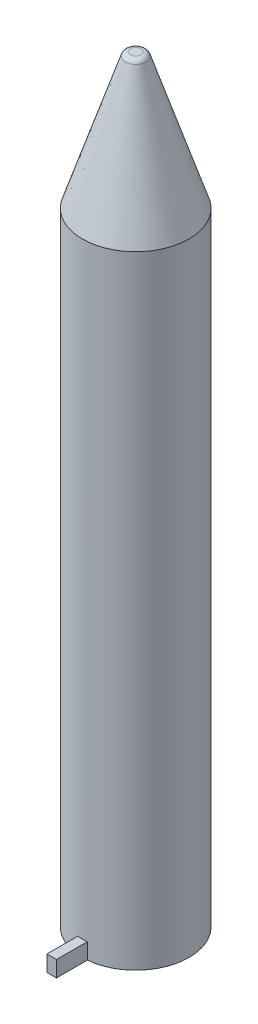
ISO-10303-21;
HEADER;
FILE_DESCRIPTION(('STEP AP214'),'2;1');
FILE_NAME('part.step','',(''),(''),'','','');
FILE_SCHEMA(('AUTOMOTIVE_DESIGN { 1 0 10303 214 1 1 1 1 }'));
ENDSEC;
DATA;
#1=APPLICATION_CONTEXT('core data for automotive mechanical design processes');
#2=APPLICATION_PROTOCOL_DEFINITION('international standard','automotive_design',2000,#1);
#3=PRODUCT_CONTEXT('',#1,'mechanical');
#4=PRODUCT('Part','Part','',(#3));
#5=PRODUCT_RELATED_PRODUCT_CATEGORY('part','',(#4));
#6=PRODUCT_DEFINITION_FORMATION('','',#4);
#7=PRODUCT_DEFINITION_CONTEXT('part definition',#1,'design');
#8=PRODUCT_DEFINITION('design','',#6,#7);
#9=PRODUCT_DEFINITION_SHAPE('','',#8);
#10=(LENGTH_UNIT() NAMED_UNIT(*) SI_UNIT(.MILLI.,.METRE.));
#11=(NAMED_UNIT(*) PLANE_ANGLE_UNIT() SI_UNIT($,.RADIAN.));
#12=(NAMED_UNIT(*) SI_UNIT($,.STERADIAN.) SOLID_ANGLE_UNIT());
#13=UNCERTAINTY_MEASURE_WITH_UNIT(LENGTH_MEASURE(1.E-05),#10,'distance_accuracy_value','');
#14=(GEOMETRIC_REPRESENTATION_CONTEXT(3) GLOBAL_UNCERTAINTY_ASSIGNED_CONTEXT((#13)) GLOBAL_UNIT_ASSIGNED_CONTEXT((#10,
#11,#12)) REPRESENTATION_CONTEXT('',''));
#15=CARTESIAN_POINT('',(0.,0.,0.));
#16=DIRECTION('',(0.,0.,1.));
#17=DIRECTION('',(1.,0.,0.));
#18=AXIS2_PLACEMENT_3D('',#15,#16,#17);
#19=CARTESIAN_POINT('',(0.,116.650008,0.));
#20=DIRECTION('',(0.,-1.,0.));
#21=DIRECTION('',(0.,0.,-1.));
#22=AXIS2_PLACEMENT_3D('',#19,#20,#21);
#23=CYLINDRICAL_SURFACE('',#22,10.);
#24=CARTESIAN_POINT('',(0.,0.,0.));
#25=DIRECTION('',(0.,1.,0.));
#26=DIRECTION('',(0.,0.,1.));
#27=AXIS2_PLACEMENT_3D('',#24,#25,#26);
#28=CIRCLE('',#27,10.);
#29=CARTESIAN_POINT('',(0.899999999999999,0.,9.95941765365827));
#30=VERTEX_POINT('',#29);
#31=CARTESIAN_POINT('',(-0.900000000000001,0.,9.95941765365827));
#32=VERTEX_POINT('',#31);
#33=EDGE_CURVE('E117',#30,#32,#28,.T.);
#34=ORIENTED_EDGE('',*,*,#33,.T.);
#35=DIRECTION('',(0.,-1.,0.));
#36=VECTOR('',#35,1.);
#37=CARTESIAN_POINT('',(-0.900000000000001,116.650008,9.95941765365827));
#38=LINE('',#37,#36);
#39=CARTESIAN_POINT('',(-0.900000000000001,3.,9.95941765365827));
#40=VERTEX_POINT('',#39);
#41=EDGE_CURVE('E53',#32,#40,#38,.F.);
#42=ORIENTED_EDGE('',*,*,#41,.T.);
#43=CARTESIAN_POINT('',(0.,3.,0.));
#44=DIRECTION('',(0.,-1.,0.));
#45=DIRECTION('',(0.,0.,-1.));
#46=AXIS2_PLACEMENT_3D('',#43,#44,#45);
#47=CIRCLE('',#46,10.);
#48=CARTESIAN_POINT('',(0.899999999999999,3.,9.95941765365827));
#49=VERTEX_POINT('',#48);
#50=EDGE_CURVE('E11',#49,#40,#47,.T.);
#51=ORIENTED_EDGE('',*,*,#50,.F.);
#52=DIRECTION('',(0.,-1.,0.));
#53=VECTOR('',#52,1.);
#54=CARTESIAN_POINT('',(0.899999999999999,116.650008,9.95941765365827));
#55=LINE('',#54,#53);
#56=EDGE_CURVE('E82',#49,#30,#55,.T.);
#57=ORIENTED_EDGE('',*,*,#56,.T.);
#58=EDGE_LOOP('',(#34,#42,#51,#57));
#59=FACE_BOUND('',#58,.T.);
#60=CARTESIAN_POINT('',(0.,116.650008,0.));
#61=DIRECTION('',(0.,1.,0.));
#62=DIRECTION('',(0.,0.,1.));
#63=AXIS2_PLACEMENT_3D('',#60,#61,#62);
#64=CIRCLE('',#63,10.);
#65=CARTESIAN_POINT('',(0.,116.650008,10.));
#66=VERTEX_POINT('',#65);
#67=EDGE_CURVE('E46',#66,#66,#64,.T.);
#68=ORIENTED_EDGE('',*,*,#67,.F.);
#69=EDGE_LOOP('',(#68));
#70=FACE_BOUND('',#69,.T.);
#71=ADVANCED_FACE('F39',(#59,#70),#23,.T.);
#72=CARTESIAN_POINT('',(0.,0.,0.));
#73=DIRECTION('',(0.,1.,0.));
#74=DIRECTION('',(0.,0.,1.));
#75=AXIS2_PLACEMENT_3D('',#72,#73,#74);
#76=PLANE('',#75);
#77=CARTESIAN_POINT('',(0.,0.,0.));
#78=DIRECTION('',(0.,-1.,0.));
#79=DIRECTION('',(0.,0.,-1.));
#80=AXIS2_PLACEMENT_3D('',#77,#78,#79);
#81=CIRCLE('',#80,6.);
#82=CARTESIAN_POINT('',(0.,0.,-6.));
#83=VERTEX_POINT('',#82);
#84=EDGE_CURVE('E163',#83,#83,#81,.T.);
#85=ORIENTED_EDGE('',*,*,#84,.F.);
#86=EDGE_LOOP('',(#85));
#87=FACE_BOUND('',#86,.T.);
#88=ORIENTED_EDGE('',*,*,#33,.F.);
#89=DIRECTION('',(0.,0.,1.));
#90=VECTOR('',#89,1.);
#91=CARTESIAN_POINT('',(0.899999999999998,0.,15.75));
#92=LINE('',#91,#90);
#93=CARTESIAN_POINT('',(0.899999999999998,0.,15.75));
#94=VERTEX_POINT('',#93);
#95=EDGE_CURVE('E104',#30,#94,#92,.T.);
#96=ORIENTED_EDGE('',*,*,#95,.T.);
#97=DIRECTION('',(-1.,0.,0.));
#98=VECTOR('',#97,1.);
#99=CARTESIAN_POINT('',(-0.900000000000002,0.,15.75));
#100=LINE('',#99,#98);
#101=CARTESIAN_POINT('',(-0.900000000000002,0.,15.75));
#102=VERTEX_POINT('',#101);
#103=EDGE_CURVE('E92',#94,#102,#100,.T.);
#104=ORIENTED_EDGE('',*,*,#103,.T.);
#105=DIRECTION('',(0.,0.,-1.));
#106=VECTOR('',#105,1.);
#107=CARTESIAN_POINT('',(-0.900000000000002,0.,15.75));
#108=LINE('',#107,#106);
#109=EDGE_CURVE('E101',#102,#32,#108,.T.);
#110=ORIENTED_EDGE('',*,*,#109,.T.);
#111=EDGE_LOOP('',(#88,#96,#104,#110));
#112=FACE_BOUND('',#111,.T.);
#113=ADVANCED_FACE('F124',(#87,#112),#76,.F.);
#114=CARTESIAN_POINT('',(1.,142.050008,0.));
#115=DIRECTION('',(0.,1.,0.));
#116=DIRECTION('',(0.,0.,1.));
#117=AXIS2_PLACEMENT_3D('',#114,#115,#116);
#118=PLANE('',#117);
#119=CARTESIAN_POINT('',(0.,142.050008,0.));
#120=DIRECTION('',(0.,-1.,0.));
#121=DIRECTION('',(0.,0.,-1.));
#122=AXIS2_PLACEMENT_3D('',#119,#120,#121);
#123=CIRCLE('',#122,1.);
#124=CARTESIAN_POINT('',(0.,142.050008,-1.));
#125=VERTEX_POINT('',#124);
#126=EDGE_CURVE('E114',#125,#125,#123,.T.);
#127=ORIENTED_EDGE('',*,*,#126,.F.);
#128=EDGE_LOOP('',(#127));
#129=FACE_BOUND('',#128,.T.);
#130=ADVANCED_FACE('F126',(#129),#118,.T.);
#131=CARTESIAN_POINT('',(0.,141.050008,0.));
#132=DIRECTION('',(0.,-1.,0.));
#133=DIRECTION('',(0.,0.,-1.));
#134=AXIS2_PLACEMENT_3D('',#131,#132,#133);
#135=DEGENERATE_TOROIDAL_SURFACE('',#134,1.,1.,.T.);
#136=ORIENTED_EDGE('',*,*,#126,.T.);
#137=EDGE_LOOP('',(#136));
#138=FACE_BOUND('',#137,.T.);
#139=CARTESIAN_POINT('',(0.,141.359738327842,0.));
#140=DIRECTION('',(0.,-1.,0.));
#141=DIRECTION('',(0.,0.,-1.));
#142=AXIS2_PLACEMENT_3D('',#139,#140,#141);
#143=CIRCLE('',#142,1.95082444437176);
#144=CARTESIAN_POINT('',(0.,141.359738327842,-1.95082444437176));
#145=VERTEX_POINT('',#144);
#146=EDGE_CURVE('E111',#145,#145,#143,.T.);
#147=ORIENTED_EDGE('',*,*,#146,.F.);
#148=EDGE_LOOP('',(#147));
#149=FACE_BOUND('',#148,.T.);
#150=ADVANCED_FACE('F132',(#138,#149),#135,.T.);
#151=CARTESIAN_POINT('',(0.,116.650008,0.));
#152=DIRECTION('',(0.,-1.,0.));
#153=DIRECTION('',(0.,0.,-1.));
#154=AXIS2_PLACEMENT_3D('',#151,#152,#153);
#155=CONICAL_SURFACE('',#154,10.,0.314909400039748);
#156=ORIENTED_EDGE('',*,*,#146,.T.);
#157=EDGE_LOOP('',(#156));
#158=FACE_BOUND('',#157,.T.);
#159=ORIENTED_EDGE('',*,*,#67,.T.);
#160=EDGE_LOOP('',(#159));
#161=FACE_BOUND('',#160,.T.);
#162=ADVANCED_FACE('F139',(#158,#161),#155,.T.);
#163=CARTESIAN_POINT('',(-0.900000000000002,3.,15.75));
#164=DIRECTION('',(-1.,0.,0.));
#165=DIRECTION('',(0.,0.,1.));
#166=AXIS2_PLACEMENT_3D('',#163,#164,#165);
#167=PLANE('',#166);
#168=ORIENTED_EDGE('',*,*,#41,.F.);
#169=ORIENTED_EDGE('',*,*,#109,.F.);
#170=DIRECTION('',(0.,-1.,0.));
#171=VECTOR('',#170,1.);
#172=CARTESIAN_POINT('',(-0.900000000000002,3.,15.75));
#173=LINE('',#172,#171);
#174=CARTESIAN_POINT('',(-0.900000000000002,3.,15.75));
#175=VERTEX_POINT('',#174);
#176=EDGE_CURVE('E93',#175,#102,#173,.T.);
#177=ORIENTED_EDGE('',*,*,#176,.F.);
#178=DIRECTION('',(0.,0.,-1.));
#179=VECTOR('',#178,1.);
#180=CARTESIAN_POINT('',(-0.900000000000002,3.,15.75));
#181=LINE('',#180,#179);
#182=EDGE_CURVE('E86',#175,#40,#181,.T.);
#183=ORIENTED_EDGE('',*,*,#182,.T.);
#184=EDGE_LOOP('',(#168,#169,#177,#183));
#185=FACE_BOUND('',#184,.T.);
#186=ADVANCED_FACE('F123',(#185),#167,.T.);
#187=CARTESIAN_POINT('',(0.899999999999998,3.,15.75));
#188=DIRECTION('',(1.,0.,0.));
#189=DIRECTION('',(0.,0.,-1.));
#190=AXIS2_PLACEMENT_3D('',#187,#188,#189);
#191=PLANE('',#190);
#192=ORIENTED_EDGE('',*,*,#56,.F.);
#193=DIRECTION('',(0.,0.,1.));
#194=VECTOR('',#193,1.);
#195=CARTESIAN_POINT('',(0.899999999999998,3.,15.75));
#196=LINE('',#195,#194);
#197=CARTESIAN_POINT('',(0.899999999999998,3.,15.75));
#198=VERTEX_POINT('',#197);
#199=EDGE_CURVE('E76',#49,#198,#196,.T.);
#200=ORIENTED_EDGE('',*,*,#199,.T.);
#201=DIRECTION('',(0.,-1.,0.));
#202=VECTOR('',#201,1.);
#203=CARTESIAN_POINT('',(0.899999999999998,3.,15.75));
#204=LINE('',#203,#202);
#205=EDGE_CURVE('E80',#198,#94,#204,.T.);
#206=ORIENTED_EDGE('',*,*,#205,.T.);
#207=ORIENTED_EDGE('',*,*,#95,.F.);
#208=EDGE_LOOP('',(#192,#200,#206,#207));
#209=FACE_BOUND('',#208,.T.);
#210=ADVANCED_FACE('F78',(#209),#191,.T.);
#211=CARTESIAN_POINT('',(-0.900000000000002,3.,15.75));
#212=DIRECTION('',(0.,0.,1.));
#213=DIRECTION('',(1.,0.,0.));
#214=AXIS2_PLACEMENT_3D('',#211,#212,#213);
#215=PLANE('',#214);
#216=ORIENTED_EDGE('',*,*,#103,.F.);
#217=ORIENTED_EDGE('',*,*,#205,.F.);
#218=DIRECTION('',(-1.,0.,0.));
#219=VECTOR('',#218,1.);
#220=CARTESIAN_POINT('',(-0.900000000000002,3.,15.75));
#221=LINE('',#220,#219);
#222=EDGE_CURVE('E85',#198,#175,#221,.T.);
#223=ORIENTED_EDGE('',*,*,#222,.T.);
#224=ORIENTED_EDGE('',*,*,#176,.T.);
#225=EDGE_LOOP('',(#216,#217,#223,#224));
#226=FACE_BOUND('',#225,.T.);
#227=ADVANCED_FACE('F90',(#226),#215,.T.);
#228=CARTESIAN_POINT('',(0.,3.,0.));
#229=DIRECTION('',(0.,-1.,0.));
#230=DIRECTION('',(0.,0.,-1.));
#231=AXIS2_PLACEMENT_3D('',#228,#229,#230);
#232=PLANE('',#231);
#233=ORIENTED_EDGE('',*,*,#199,.F.);
#234=ORIENTED_EDGE('',*,*,#50,.T.);
#235=ORIENTED_EDGE('',*,*,#182,.F.);
#236=ORIENTED_EDGE('',*,*,#222,.F.);
#237=EDGE_LOOP('',(#233,#234,#235,#236));
#238=FACE_BOUND('',#237,.T.);
#239=ADVANCED_FACE('F96',(#238),#232,.F.);
#240=CARTESIAN_POINT('',(0.,3.,0.));
#241=DIRECTION('',(0.,-1.,0.));
#242=DIRECTION('',(0.,0.,-1.));
#243=AXIS2_PLACEMENT_3D('',#240,#241,#242);
#244=CYLINDRICAL_SURFACE('',#243,6.);
#245=CARTESIAN_POINT('',(0.,3.,0.));
#246=DIRECTION('',(0.,-1.,0.));
#247=DIRECTION('',(0.,0.,-1.));
#248=AXIS2_PLACEMENT_3D('',#245,#246,#247);
#249=CIRCLE('',#248,6.);
#250=CARTESIAN_POINT('',(0.,3.,-6.));
#251=VERTEX_POINT('',#250);
#252=EDGE_CURVE('E105',#251,#251,#249,.T.);
#253=ORIENTED_EDGE('',*,*,#252,.F.);
#254=EDGE_LOOP('',(#253));
#255=FACE_BOUND('',#254,.T.);
#256=ORIENTED_EDGE('',*,*,#84,.T.);
#257=EDGE_LOOP('',(#256));
#258=FACE_BOUND('',#257,.T.);
#259=ADVANCED_FACE('F152',(#255,#258),#244,.F.);
#260=CARTESIAN_POINT('',(0.,3.,0.));
#261=DIRECTION('',(0.,-1.,0.));
#262=DIRECTION('',(0.,0.,-1.));
#263=AXIS2_PLACEMENT_3D('',#260,#261,#262);
#264=PLANE('',#263);
#265=ORIENTED_EDGE('',*,*,#252,.T.);
#266=EDGE_LOOP('',(#265));
#267=FACE_BOUND('',#266,.T.);
#268=ADVANCED_FACE('F155',(#267),#264,.T.);
#269=CLOSED_SHELL('',(#71,#113,#130,#150,#162,#186,#210,#227,#239,#259,#268));
#270=MANIFOLD_SOLID_BREP('B2',#269);
#271=ADVANCED_BREP_SHAPE_REPRESENTATION('',(#18,#270),#14);
#272=SHAPE_DEFINITION_REPRESENTATION(#9,#271);
ENDSEC;
END-ISO-10303-21;
